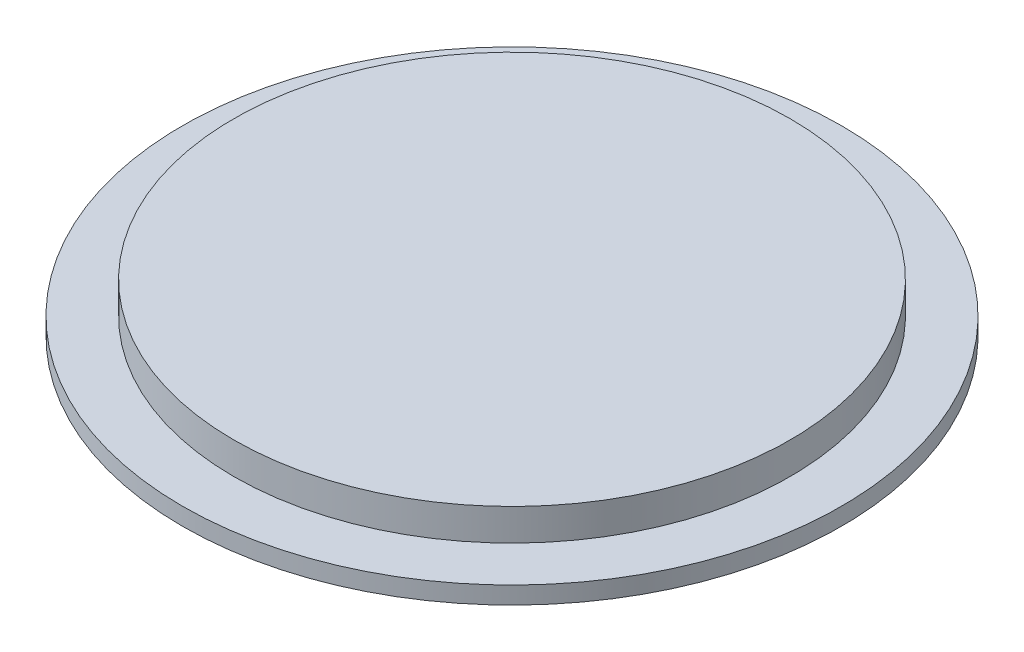
ISO-10303-21;
HEADER;
FILE_DESCRIPTION(('STEP AP214'),'2;1');
FILE_NAME('part.step','',(''),(''),'','','');
FILE_SCHEMA(('AUTOMOTIVE_DESIGN { 1 0 10303 214 1 1 1 1 }'));
ENDSEC;
DATA;
#1=APPLICATION_CONTEXT('core data for automotive mechanical design processes');
#2=APPLICATION_PROTOCOL_DEFINITION('international standard','automotive_design',2000,#1);
#3=PRODUCT_CONTEXT('',#1,'mechanical');
#4=PRODUCT('Part','Part','',(#3));
#5=PRODUCT_RELATED_PRODUCT_CATEGORY('part','',(#4));
#6=PRODUCT_DEFINITION_FORMATION('','',#4);
#7=PRODUCT_DEFINITION_CONTEXT('part definition',#1,'design');
#8=PRODUCT_DEFINITION('design','',#6,#7);
#9=PRODUCT_DEFINITION_SHAPE('','',#8);
#10=(LENGTH_UNIT() NAMED_UNIT(*) SI_UNIT(.MILLI.,.METRE.));
#11=(NAMED_UNIT(*) PLANE_ANGLE_UNIT() SI_UNIT($,.RADIAN.));
#12=(NAMED_UNIT(*) SI_UNIT($,.STERADIAN.) SOLID_ANGLE_UNIT());
#13=UNCERTAINTY_MEASURE_WITH_UNIT(LENGTH_MEASURE(1.E-05),#10,'distance_accuracy_value','');
#14=(GEOMETRIC_REPRESENTATION_CONTEXT(3) GLOBAL_UNCERTAINTY_ASSIGNED_CONTEXT((#13)) GLOBAL_UNIT_ASSIGNED_CONTEXT((#10,
#11,#12)) REPRESENTATION_CONTEXT('',''));
#15=CARTESIAN_POINT('',(0.,0.,0.));
#16=DIRECTION('',(0.,0.,1.));
#17=DIRECTION('',(1.,0.,0.));
#18=AXIS2_PLACEMENT_3D('',#15,#16,#17);
#19=CARTESIAN_POINT('',(0.,2.8702,0.));
#20=DIRECTION('',(0.,-1.,0.));
#21=DIRECTION('',(0.,0.,-1.));
#22=AXIS2_PLACEMENT_3D('',#19,#20,#21);
#23=CYLINDRICAL_SURFACE('',#22,16.256);
#24=CARTESIAN_POINT('',(0.,2.8702,0.));
#25=DIRECTION('',(0.,1.,0.));
#26=DIRECTION('',(0.,0.,1.));
#27=AXIS2_PLACEMENT_3D('',#24,#25,#26);
#28=CIRCLE('',#27,16.256);
#29=CARTESIAN_POINT('',(0.,2.8702,16.256));
#30=VERTEX_POINT('',#29);
#31=EDGE_CURVE('E43',#30,#30,#28,.T.);
#32=ORIENTED_EDGE('',*,*,#31,.F.);
#33=EDGE_LOOP('',(#32));
#34=FACE_BOUND('',#33,.T.);
#35=CARTESIAN_POINT('',(0.,1.016,0.));
#36=DIRECTION('',(0.,-1.,0.));
#37=DIRECTION('',(0.,0.,-1.));
#38=AXIS2_PLACEMENT_3D('',#35,#36,#37);
#39=CIRCLE('',#38,16.256);
#40=CARTESIAN_POINT('',(0.,1.016,-16.256));
#41=VERTEX_POINT('',#40);
#42=EDGE_CURVE('E10',#41,#41,#39,.T.);
#43=ORIENTED_EDGE('',*,*,#42,.F.);
#44=EDGE_LOOP('',(#43));
#45=FACE_BOUND('',#44,.T.);
#46=ADVANCED_FACE('F37',(#34,#45),#23,.T.);
#47=CARTESIAN_POINT('',(0.,2.8702,0.));
#48=DIRECTION('',(0.,1.,0.));
#49=DIRECTION('',(0.,0.,1.));
#50=AXIS2_PLACEMENT_3D('',#47,#48,#49);
#51=PLANE('',#50);
#52=ORIENTED_EDGE('',*,*,#31,.T.);
#53=EDGE_LOOP('',(#52));
#54=FACE_BOUND('',#53,.T.);
#55=ADVANCED_FACE('F62',(#54),#51,.T.);
#56=CARTESIAN_POINT('',(0.,1.016,0.));
#57=DIRECTION('',(0.,-1.,0.));
#58=DIRECTION('',(0.,0.,-1.));
#59=AXIS2_PLACEMENT_3D('',#56,#57,#58);
#60=CYLINDRICAL_SURFACE('',#59,19.256);
#61=CARTESIAN_POINT('',(0.,1.016,0.));
#62=DIRECTION('',(0.,-1.,0.));
#63=DIRECTION('',(0.,0.,-1.));
#64=AXIS2_PLACEMENT_3D('',#61,#62,#63);
#65=CIRCLE('',#64,19.256);
#66=CARTESIAN_POINT('',(0.,1.016,-19.256));
#67=VERTEX_POINT('',#66);
#68=EDGE_CURVE('E47',#67,#67,#65,.T.);
#69=ORIENTED_EDGE('',*,*,#68,.T.);
#70=EDGE_LOOP('',(#69));
#71=FACE_BOUND('',#70,.T.);
#72=CARTESIAN_POINT('',(0.,0.,0.));
#73=DIRECTION('',(0.,-1.,0.));
#74=DIRECTION('',(0.,0.,-1.));
#75=AXIS2_PLACEMENT_3D('',#72,#73,#74);
#76=CIRCLE('',#75,19.256);
#77=CARTESIAN_POINT('',(0.,0.,-19.256));
#78=VERTEX_POINT('',#77);
#79=EDGE_CURVE('E51',#78,#78,#76,.T.);
#80=ORIENTED_EDGE('',*,*,#79,.F.);
#81=EDGE_LOOP('',(#80));
#82=FACE_BOUND('',#81,.T.);
#83=ADVANCED_FACE('F59',(#71,#82),#60,.T.);
#84=CARTESIAN_POINT('',(0.,1.016,0.));
#85=DIRECTION('',(0.,-1.,0.));
#86=DIRECTION('',(0.,0.,-1.));
#87=AXIS2_PLACEMENT_3D('',#84,#85,#86);
#88=PLANE('',#87);
#89=ORIENTED_EDGE('',*,*,#42,.T.);
#90=EDGE_LOOP('',(#89));
#91=FACE_BOUND('',#90,.T.);
#92=ORIENTED_EDGE('',*,*,#68,.F.);
#93=EDGE_LOOP('',(#92));
#94=FACE_BOUND('',#93,.T.);
#95=ADVANCED_FACE('F61',(#91,#94),#88,.F.);
#96=CARTESIAN_POINT('',(0.,0.,0.));
#97=DIRECTION('',(0.,1.,0.));
#98=DIRECTION('',(0.,0.,1.));
#99=AXIS2_PLACEMENT_3D('',#96,#97,#98);
#100=PLANE('',#99);
#101=ORIENTED_EDGE('',*,*,#79,.T.);
#102=EDGE_LOOP('',(#101));
#103=FACE_BOUND('',#102,.T.);
#104=ADVANCED_FACE('F57',(#103),#100,.F.);
#105=CLOSED_SHELL('',(#46,#55,#83,#95,#104));
#106=MANIFOLD_SOLID_BREP('B2',#105);
#107=ADVANCED_BREP_SHAPE_REPRESENTATION('',(#18,#106),#14);
#108=SHAPE_DEFINITION_REPRESENTATION(#9,#107);
ENDSEC;
END-ISO-10303-21;
